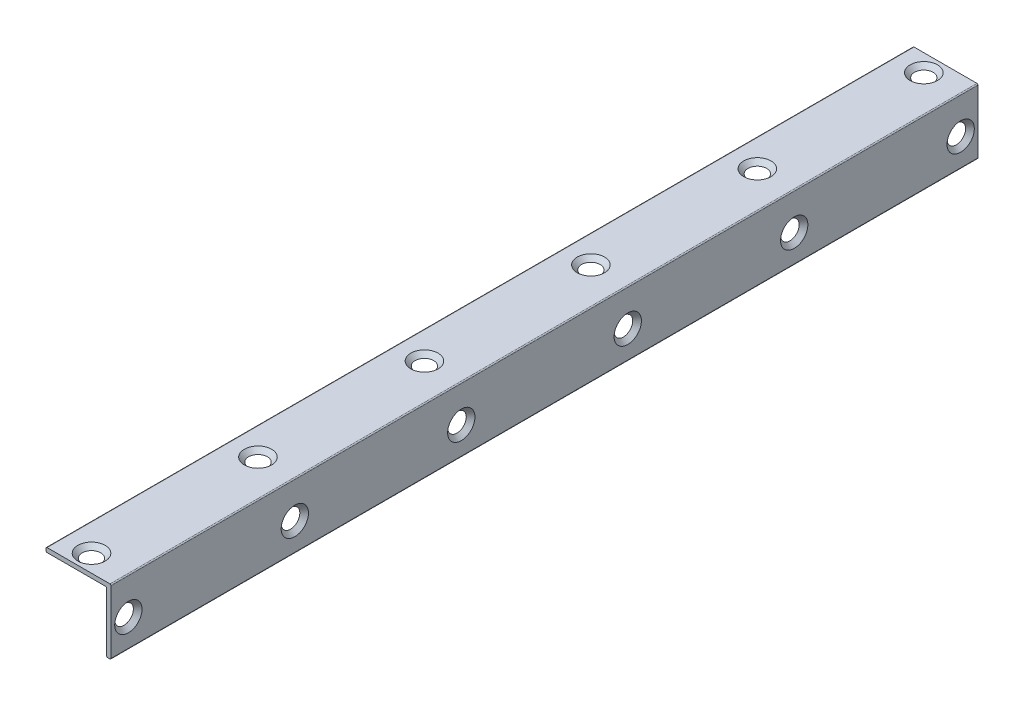
ISO-10303-21;
HEADER;
FILE_DESCRIPTION(('STEP AP214'),'2;1');
FILE_NAME('part.step','',(''),(''),'','','');
FILE_SCHEMA(('AUTOMOTIVE_DESIGN { 1 0 10303 214 1 1 1 1 }'));
ENDSEC;
DATA;
#1=APPLICATION_CONTEXT('core data for automotive mechanical design processes');
#2=APPLICATION_PROTOCOL_DEFINITION('international standard','automotive_design',2000,#1);
#3=PRODUCT_CONTEXT('',#1,'mechanical');
#4=PRODUCT('Part','Part','',(#3));
#5=PRODUCT_RELATED_PRODUCT_CATEGORY('part','',(#4));
#6=PRODUCT_DEFINITION_FORMATION('','',#4);
#7=PRODUCT_DEFINITION_CONTEXT('part definition',#1,'design');
#8=PRODUCT_DEFINITION('design','',#6,#7);
#9=PRODUCT_DEFINITION_SHAPE('','',#8);
#10=(LENGTH_UNIT() NAMED_UNIT(*) SI_UNIT(.MILLI.,.METRE.));
#11=(NAMED_UNIT(*) PLANE_ANGLE_UNIT() SI_UNIT($,.RADIAN.));
#12=(NAMED_UNIT(*) SI_UNIT($,.STERADIAN.) SOLID_ANGLE_UNIT());
#13=UNCERTAINTY_MEASURE_WITH_UNIT(LENGTH_MEASURE(1.E-05),#10,'distance_accuracy_value','');
#14=(GEOMETRIC_REPRESENTATION_CONTEXT(3) GLOBAL_UNCERTAINTY_ASSIGNED_CONTEXT((#13)) GLOBAL_UNIT_ASSIGNED_CONTEXT((#10,
#11,#12)) REPRESENTATION_CONTEXT('',''));
#15=CARTESIAN_POINT('',(0.,0.,0.));
#16=DIRECTION('',(0.,0.,1.));
#17=DIRECTION('',(1.,0.,0.));
#18=AXIS2_PLACEMENT_3D('',#15,#16,#17);
#19=CARTESIAN_POINT('',(0.,15.,200.));
#20=DIRECTION('',(0.,-1.,0.));
#21=DIRECTION('',(1.,0.,0.));
#22=AXIS2_PLACEMENT_3D('',#19,#20,#21);
#23=PLANE('',#22);
#24=CARTESIAN_POINT('',(-8.5,15.,157.6));
#25=DIRECTION('',(0.,1.,0.));
#26=DIRECTION('',(0.,0.,1.));
#27=AXIS2_PLACEMENT_3D('',#24,#25,#26);
#28=CIRCLE('',#27,3.15);
#29=CARTESIAN_POINT('',(-8.5,15.,160.75));
#30=VERTEX_POINT('',#29);
#31=EDGE_CURVE('E269',#30,#30,#28,.T.);
#32=ORIENTED_EDGE('',*,*,#31,.F.);
#33=EDGE_LOOP('',(#32));
#34=FACE_BOUND('',#33,.T.);
#35=CARTESIAN_POINT('',(-8.5,15.,80.8));
#36=DIRECTION('',(0.,1.,0.));
#37=DIRECTION('',(0.,0.,1.));
#38=AXIS2_PLACEMENT_3D('',#35,#36,#37);
#39=CIRCLE('',#38,3.15);
#40=CARTESIAN_POINT('',(-8.5,15.,83.95));
#41=VERTEX_POINT('',#40);
#42=EDGE_CURVE('E257',#41,#41,#39,.T.);
#43=ORIENTED_EDGE('',*,*,#42,.F.);
#44=EDGE_LOOP('',(#43));
#45=FACE_BOUND('',#44,.T.);
#46=CARTESIAN_POINT('',(-8.5,15.,4.));
#47=DIRECTION('',(0.,1.,0.));
#48=DIRECTION('',(0.,0.,1.));
#49=AXIS2_PLACEMENT_3D('',#46,#47,#48);
#50=CIRCLE('',#49,3.15);
#51=CARTESIAN_POINT('',(-8.5,15.,7.15));
#52=VERTEX_POINT('',#51);
#53=EDGE_CURVE('E245',#52,#52,#50,.T.);
#54=ORIENTED_EDGE('',*,*,#53,.F.);
#55=EDGE_LOOP('',(#54));
#56=FACE_BOUND('',#55,.T.);
#57=DIRECTION('',(-1.,0.,0.));
#58=VECTOR('',#57,1.);
#59=CARTESIAN_POINT('',(0.,15.,200.));
#60=LINE('',#59,#58);
#61=CARTESIAN_POINT('',(-0.25,15.,200.));
#62=VERTEX_POINT('',#61);
#63=CARTESIAN_POINT('',(-14.75,15.,200.));
#64=VERTEX_POINT('',#63);
#65=EDGE_CURVE('E147',#62,#64,#60,.T.);
#66=ORIENTED_EDGE('',*,*,#65,.F.);
#67=DIRECTION('',(0.,0.,-1.));
#68=VECTOR('',#67,1.);
#69=CARTESIAN_POINT('',(-0.25,15.,200.));
#70=LINE('',#69,#68);
#71=CARTESIAN_POINT('',(-0.25,15.,0.));
#72=VERTEX_POINT('',#71);
#73=EDGE_CURVE('E186',#62,#72,#70,.T.);
#74=ORIENTED_EDGE('',*,*,#73,.T.);
#75=DIRECTION('',(-1.,0.,0.));
#76=VECTOR('',#75,1.);
#77=CARTESIAN_POINT('',(0.,15.,0.));
#78=LINE('',#77,#76);
#79=CARTESIAN_POINT('',(-14.75,15.,0.));
#80=VERTEX_POINT('',#79);
#81=EDGE_CURVE('E197',#72,#80,#78,.T.);
#82=ORIENTED_EDGE('',*,*,#81,.T.);
#83=DIRECTION('',(0.,0.,-1.));
#84=VECTOR('',#83,1.);
#85=CARTESIAN_POINT('',(-14.75,15.,200.));
#86=LINE('',#85,#84);
#87=EDGE_CURVE('E184',#80,#64,#86,.F.);
#88=ORIENTED_EDGE('',*,*,#87,.T.);
#89=EDGE_LOOP('',(#66,#74,#82,#88));
#90=FACE_BOUND('',#89,.T.);
#91=CARTESIAN_POINT('',(-8.5,15.,42.4));
#92=DIRECTION('',(0.,1.,0.));
#93=DIRECTION('',(0.,0.,1.));
#94=AXIS2_PLACEMENT_3D('',#91,#92,#93);
#95=CIRCLE('',#94,3.15);
#96=CARTESIAN_POINT('',(-8.5,15.,45.55));
#97=VERTEX_POINT('',#96);
#98=EDGE_CURVE('E251',#97,#97,#95,.T.);
#99=ORIENTED_EDGE('',*,*,#98,.F.);
#100=EDGE_LOOP('',(#99));
#101=FACE_BOUND('',#100,.T.);
#102=CARTESIAN_POINT('',(-8.5,15.,119.2));
#103=DIRECTION('',(0.,1.,0.));
#104=DIRECTION('',(0.,0.,1.));
#105=AXIS2_PLACEMENT_3D('',#102,#103,#104);
#106=CIRCLE('',#105,3.15);
#107=CARTESIAN_POINT('',(-8.5,15.,122.35));
#108=VERTEX_POINT('',#107);
#109=EDGE_CURVE('E263',#108,#108,#106,.T.);
#110=ORIENTED_EDGE('',*,*,#109,.F.);
#111=EDGE_LOOP('',(#110));
#112=FACE_BOUND('',#111,.T.);
#113=CARTESIAN_POINT('',(-8.5,15.,196.));
#114=DIRECTION('',(0.,1.,0.));
#115=DIRECTION('',(0.,0.,1.));
#116=AXIS2_PLACEMENT_3D('',#113,#114,#115);
#117=CIRCLE('',#116,3.15);
#118=CARTESIAN_POINT('',(-8.5,15.,199.15));
#119=VERTEX_POINT('',#118);
#120=EDGE_CURVE('E275',#119,#119,#117,.T.);
#121=ORIENTED_EDGE('',*,*,#120,.F.);
#122=EDGE_LOOP('',(#121));
#123=FACE_BOUND('',#122,.T.);
#124=ADVANCED_FACE('F31',(#34,#45,#56,#90,#101,#112,#123),#23,.F.);
#125=CARTESIAN_POINT('',(0.,0.,200.));
#126=DIRECTION('',(-1.,0.,0.));
#127=DIRECTION('',(0.,0.,1.));
#128=AXIS2_PLACEMENT_3D('',#125,#126,#127);
#129=PLANE('',#128);
#130=CARTESIAN_POINT('',(0.,6.5,157.6));
#131=DIRECTION('',(1.,0.,0.));
#132=DIRECTION('',(0.,0.,-1.));
#133=AXIS2_PLACEMENT_3D('',#130,#131,#132);
#134=CIRCLE('',#133,3.15);
#135=CARTESIAN_POINT('',(0.,6.5,154.45));
#136=VERTEX_POINT('',#135);
#137=EDGE_CURVE('E233',#136,#136,#134,.T.);
#138=ORIENTED_EDGE('',*,*,#137,.F.);
#139=EDGE_LOOP('',(#138));
#140=FACE_BOUND('',#139,.T.);
#141=CARTESIAN_POINT('',(0.,6.5,80.8));
#142=DIRECTION('',(1.,0.,0.));
#143=DIRECTION('',(0.,0.,-1.));
#144=AXIS2_PLACEMENT_3D('',#141,#142,#143);
#145=CIRCLE('',#144,3.15);
#146=CARTESIAN_POINT('',(0.,6.5,77.65));
#147=VERTEX_POINT('',#146);
#148=EDGE_CURVE('E221',#147,#147,#145,.T.);
#149=ORIENTED_EDGE('',*,*,#148,.F.);
#150=EDGE_LOOP('',(#149));
#151=FACE_BOUND('',#150,.T.);
#152=CARTESIAN_POINT('',(0.,6.5,4.));
#153=DIRECTION('',(1.,0.,0.));
#154=DIRECTION('',(0.,0.,-1.));
#155=AXIS2_PLACEMENT_3D('',#152,#153,#154);
#156=CIRCLE('',#155,3.15);
#157=CARTESIAN_POINT('',(0.,6.5,0.850000000000005));
#158=VERTEX_POINT('',#157);
#159=EDGE_CURVE('E209',#158,#158,#156,.T.);
#160=ORIENTED_EDGE('',*,*,#159,.F.);
#161=EDGE_LOOP('',(#160));
#162=FACE_BOUND('',#161,.T.);
#163=DIRECTION('',(0.,1.,0.));
#164=VECTOR('',#163,1.);
#165=CARTESIAN_POINT('',(0.,0.,200.));
#166=LINE('',#165,#164);
#167=CARTESIAN_POINT('',(0.,0.25,200.));
#168=VERTEX_POINT('',#167);
#169=CARTESIAN_POINT('',(0.,14.75,200.));
#170=VERTEX_POINT('',#169);
#171=EDGE_CURVE('E141',#168,#170,#166,.T.);
#172=ORIENTED_EDGE('',*,*,#171,.F.);
#173=DIRECTION('',(0.,0.,-1.));
#174=VECTOR('',#173,1.);
#175=CARTESIAN_POINT('',(0.,0.25,200.));
#176=LINE('',#175,#174);
#177=CARTESIAN_POINT('',(0.,0.25,0.));
#178=VERTEX_POINT('',#177);
#179=EDGE_CURVE('E181',#168,#178,#176,.T.);
#180=ORIENTED_EDGE('',*,*,#179,.T.);
#181=DIRECTION('',(0.,1.,0.));
#182=VECTOR('',#181,1.);
#183=CARTESIAN_POINT('',(0.,0.,0.));
#184=LINE('',#183,#182);
#185=CARTESIAN_POINT('',(0.,14.75,0.));
#186=VERTEX_POINT('',#185);
#187=EDGE_CURVE('E198',#178,#186,#184,.T.);
#188=ORIENTED_EDGE('',*,*,#187,.T.);
#189=DIRECTION('',(0.,0.,-1.));
#190=VECTOR('',#189,1.);
#191=CARTESIAN_POINT('',(0.,14.75,200.));
#192=LINE('',#191,#190);
#193=EDGE_CURVE('E179',#186,#170,#192,.F.);
#194=ORIENTED_EDGE('',*,*,#193,.T.);
#195=EDGE_LOOP('',(#172,#180,#188,#194));
#196=FACE_BOUND('',#195,.T.);
#197=CARTESIAN_POINT('',(0.,6.5,42.4));
#198=DIRECTION('',(1.,0.,0.));
#199=DIRECTION('',(0.,0.,-1.));
#200=AXIS2_PLACEMENT_3D('',#197,#198,#199);
#201=CIRCLE('',#200,3.15);
#202=CARTESIAN_POINT('',(0.,6.5,39.25));
#203=VERTEX_POINT('',#202);
#204=EDGE_CURVE('E215',#203,#203,#201,.T.);
#205=ORIENTED_EDGE('',*,*,#204,.F.);
#206=EDGE_LOOP('',(#205));
#207=FACE_BOUND('',#206,.T.);
#208=CARTESIAN_POINT('',(0.,6.5,119.2));
#209=DIRECTION('',(1.,0.,0.));
#210=DIRECTION('',(0.,0.,-1.));
#211=AXIS2_PLACEMENT_3D('',#208,#209,#210);
#212=CIRCLE('',#211,3.15);
#213=CARTESIAN_POINT('',(0.,6.5,116.05));
#214=VERTEX_POINT('',#213);
#215=EDGE_CURVE('E227',#214,#214,#212,.T.);
#216=ORIENTED_EDGE('',*,*,#215,.F.);
#217=EDGE_LOOP('',(#216));
#218=FACE_BOUND('',#217,.T.);
#219=CARTESIAN_POINT('',(0.,6.5,196.));
#220=DIRECTION('',(1.,0.,0.));
#221=DIRECTION('',(0.,0.,-1.));
#222=AXIS2_PLACEMENT_3D('',#219,#220,#221);
#223=CIRCLE('',#222,3.15);
#224=CARTESIAN_POINT('',(0.,6.5,192.85));
#225=VERTEX_POINT('',#224);
#226=EDGE_CURVE('E239',#225,#225,#223,.T.);
#227=ORIENTED_EDGE('',*,*,#226,.F.);
#228=EDGE_LOOP('',(#227));
#229=FACE_BOUND('',#228,.T.);
#230=ADVANCED_FACE('F282',(#140,#151,#162,#196,#207,#218,#229),#129,.F.);
#231=CARTESIAN_POINT('',(-1.,0.,200.));
#232=DIRECTION('',(0.,1.,0.));
#233=DIRECTION('',(0.,0.,1.));
#234=AXIS2_PLACEMENT_3D('',#231,#232,#233);
#235=PLANE('',#234);
#236=DIRECTION('',(1.,0.,0.));
#237=VECTOR('',#236,1.);
#238=CARTESIAN_POINT('',(-1.,0.,200.));
#239=LINE('',#238,#237);
#240=CARTESIAN_POINT('',(-0.750000000000001,0.,200.));
#241=VERTEX_POINT('',#240);
#242=CARTESIAN_POINT('',(-0.25,0.,200.));
#243=VERTEX_POINT('',#242);
#244=EDGE_CURVE('E138',#241,#243,#239,.T.);
#245=ORIENTED_EDGE('',*,*,#244,.F.);
#246=DIRECTION('',(0.,0.,-1.));
#247=VECTOR('',#246,1.);
#248=CARTESIAN_POINT('',(-0.750000000000001,0.,200.));
#249=LINE('',#248,#247);
#250=CARTESIAN_POINT('',(-0.750000000000001,0.,0.));
#251=VERTEX_POINT('',#250);
#252=EDGE_CURVE('E156',#241,#251,#249,.T.);
#253=ORIENTED_EDGE('',*,*,#252,.T.);
#254=DIRECTION('',(1.,0.,0.));
#255=VECTOR('',#254,1.);
#256=CARTESIAN_POINT('',(-1.,0.,0.));
#257=LINE('',#256,#255);
#258=CARTESIAN_POINT('',(-0.25,0.,0.));
#259=VERTEX_POINT('',#258);
#260=EDGE_CURVE('E203',#251,#259,#257,.T.);
#261=ORIENTED_EDGE('',*,*,#260,.T.);
#262=DIRECTION('',(0.,0.,-1.));
#263=VECTOR('',#262,1.);
#264=CARTESIAN_POINT('',(-0.25,0.,200.));
#265=LINE('',#264,#263);
#266=EDGE_CURVE('E133',#259,#243,#265,.F.);
#267=ORIENTED_EDGE('',*,*,#266,.T.);
#268=EDGE_LOOP('',(#245,#253,#261,#267));
#269=FACE_BOUND('',#268,.T.);
#270=ADVANCED_FACE('F33',(#269),#235,.F.);
#271=CARTESIAN_POINT('',(-15.,15.,200.));
#272=DIRECTION('',(1.,0.,0.));
#273=DIRECTION('',(0.,1.,0.));
#274=AXIS2_PLACEMENT_3D('',#271,#272,#273);
#275=PLANE('',#274);
#276=DIRECTION('',(0.,-1.,0.));
#277=VECTOR('',#276,1.);
#278=CARTESIAN_POINT('',(-15.,15.,200.));
#279=LINE('',#278,#277);
#280=CARTESIAN_POINT('',(-15.,14.75,200.));
#281=VERTEX_POINT('',#280);
#282=CARTESIAN_POINT('',(-15.,14.25,200.));
#283=VERTEX_POINT('',#282);
#284=EDGE_CURVE('E150',#281,#283,#279,.T.);
#285=ORIENTED_EDGE('',*,*,#284,.F.);
#286=DIRECTION('',(0.,0.,-1.));
#287=VECTOR('',#286,1.);
#288=CARTESIAN_POINT('',(-15.,14.75,200.));
#289=LINE('',#288,#287);
#290=CARTESIAN_POINT('',(-15.,14.75,0.));
#291=VERTEX_POINT('',#290);
#292=EDGE_CURVE('E39',#281,#291,#289,.T.);
#293=ORIENTED_EDGE('',*,*,#292,.T.);
#294=DIRECTION('',(0.,-1.,0.));
#295=VECTOR('',#294,1.);
#296=CARTESIAN_POINT('',(-15.,15.,0.));
#297=LINE('',#296,#295);
#298=CARTESIAN_POINT('',(-15.,14.25,0.));
#299=VERTEX_POINT('',#298);
#300=EDGE_CURVE('E125',#291,#299,#297,.T.);
#301=ORIENTED_EDGE('',*,*,#300,.T.);
#302=DIRECTION('',(0.,0.,-1.));
#303=VECTOR('',#302,1.);
#304=CARTESIAN_POINT('',(-15.,14.25,200.));
#305=LINE('',#304,#303);
#306=EDGE_CURVE('E54',#299,#283,#305,.F.);
#307=ORIENTED_EDGE('',*,*,#306,.T.);
#308=EDGE_LOOP('',(#285,#293,#301,#307));
#309=FACE_BOUND('',#308,.T.);
#310=ADVANCED_FACE('F192',(#309),#275,.F.);
#311=CARTESIAN_POINT('',(-15.,14.,200.));
#312=DIRECTION('',(0.,1.,0.));
#313=DIRECTION('',(-1.,0.,0.));
#314=AXIS2_PLACEMENT_3D('',#311,#312,#313);
#315=PLANE('',#314);
#316=CARTESIAN_POINT('',(-8.5,14.,196.));
#317=DIRECTION('',(0.,1.,0.));
#318=DIRECTION('',(-1.,0.,0.));
#319=AXIS2_PLACEMENT_3D('',#316,#317,#318);
#320=CIRCLE('',#319,2.14999999999999);
#321=CARTESIAN_POINT('',(-10.65,14.,196.));
#322=VERTEX_POINT('',#321);
#323=EDGE_CURVE('E272',#322,#322,#320,.T.);
#324=ORIENTED_EDGE('',*,*,#323,.T.);
#325=EDGE_LOOP('',(#324));
#326=FACE_BOUND('',#325,.T.);
#327=CARTESIAN_POINT('',(-8.5,14.,157.6));
#328=DIRECTION('',(0.,1.,0.));
#329=DIRECTION('',(-1.,0.,0.));
#330=AXIS2_PLACEMENT_3D('',#327,#328,#329);
#331=CIRCLE('',#330,2.14999999999999);
#332=CARTESIAN_POINT('',(-10.65,14.,157.6));
#333=VERTEX_POINT('',#332);
#334=EDGE_CURVE('E266',#333,#333,#331,.T.);
#335=ORIENTED_EDGE('',*,*,#334,.T.);
#336=EDGE_LOOP('',(#335));
#337=FACE_BOUND('',#336,.T.);
#338=CARTESIAN_POINT('',(-8.5,14.,119.2));
#339=DIRECTION('',(0.,1.,0.));
#340=DIRECTION('',(-1.,0.,0.));
#341=AXIS2_PLACEMENT_3D('',#338,#339,#340);
#342=CIRCLE('',#341,2.14999999999999);
#343=CARTESIAN_POINT('',(-10.65,14.,119.2));
#344=VERTEX_POINT('',#343);
#345=EDGE_CURVE('E260',#344,#344,#342,.T.);
#346=ORIENTED_EDGE('',*,*,#345,.T.);
#347=EDGE_LOOP('',(#346));
#348=FACE_BOUND('',#347,.T.);
#349=CARTESIAN_POINT('',(-8.5,14.,80.8));
#350=DIRECTION('',(0.,1.,0.));
#351=DIRECTION('',(-1.,0.,0.));
#352=AXIS2_PLACEMENT_3D('',#349,#350,#351);
#353=CIRCLE('',#352,2.14999999999999);
#354=CARTESIAN_POINT('',(-10.65,14.,80.8));
#355=VERTEX_POINT('',#354);
#356=EDGE_CURVE('E254',#355,#355,#353,.T.);
#357=ORIENTED_EDGE('',*,*,#356,.T.);
#358=EDGE_LOOP('',(#357));
#359=FACE_BOUND('',#358,.T.);
#360=CARTESIAN_POINT('',(-8.5,14.,42.4));
#361=DIRECTION('',(0.,1.,0.));
#362=DIRECTION('',(-1.,0.,0.));
#363=AXIS2_PLACEMENT_3D('',#360,#361,#362);
#364=CIRCLE('',#363,2.14999999999999);
#365=CARTESIAN_POINT('',(-10.65,14.,42.4));
#366=VERTEX_POINT('',#365);
#367=EDGE_CURVE('E248',#366,#366,#364,.T.);
#368=ORIENTED_EDGE('',*,*,#367,.T.);
#369=EDGE_LOOP('',(#368));
#370=FACE_BOUND('',#369,.T.);
#371=CARTESIAN_POINT('',(-8.5,14.,4.));
#372=DIRECTION('',(0.,1.,0.));
#373=DIRECTION('',(-1.,0.,0.));
#374=AXIS2_PLACEMENT_3D('',#371,#372,#373);
#375=CIRCLE('',#374,2.14999999999999);
#376=CARTESIAN_POINT('',(-10.65,14.,4.));
#377=VERTEX_POINT('',#376);
#378=EDGE_CURVE('E242',#377,#377,#375,.T.);
#379=ORIENTED_EDGE('',*,*,#378,.T.);
#380=EDGE_LOOP('',(#379));
#381=FACE_BOUND('',#380,.T.);
#382=DIRECTION('',(1.,0.,0.));
#383=VECTOR('',#382,1.);
#384=CARTESIAN_POINT('',(-15.,14.,200.));
#385=LINE('',#384,#383);
#386=CARTESIAN_POINT('',(-14.75,14.,200.));
#387=VERTEX_POINT('',#386);
#388=CARTESIAN_POINT('',(-1.,14.,200.));
#389=VERTEX_POINT('',#388);
#390=EDGE_CURVE('E152',#387,#389,#385,.T.);
#391=ORIENTED_EDGE('',*,*,#390,.F.);
#392=DIRECTION('',(0.,0.,-1.));
#393=VECTOR('',#392,1.);
#394=CARTESIAN_POINT('',(-14.75,14.,200.));
#395=LINE('',#394,#393);
#396=CARTESIAN_POINT('',(-14.75,14.,0.));
#397=VERTEX_POINT('',#396);
#398=EDGE_CURVE('E11',#387,#397,#395,.T.);
#399=ORIENTED_EDGE('',*,*,#398,.T.);
#400=DIRECTION('',(1.,0.,0.));
#401=VECTOR('',#400,1.);
#402=CARTESIAN_POINT('',(-15.,14.,0.));
#403=LINE('',#402,#401);
#404=CARTESIAN_POINT('',(-1.,14.,0.));
#405=VERTEX_POINT('',#404);
#406=EDGE_CURVE('E116',#397,#405,#403,.T.);
#407=ORIENTED_EDGE('',*,*,#406,.T.);
#408=DIRECTION('',(0.,0.,-1.));
#409=VECTOR('',#408,1.);
#410=CARTESIAN_POINT('',(-1.,14.,200.));
#411=LINE('',#410,#409);
#412=EDGE_CURVE('E119',#389,#405,#411,.T.);
#413=ORIENTED_EDGE('',*,*,#412,.F.);
#414=EDGE_LOOP('',(#391,#399,#407,#413));
#415=FACE_BOUND('',#414,.T.);
#416=ADVANCED_FACE('F118',(#326,#337,#348,#359,#370,#381,#415),#315,.F.);
#417=CARTESIAN_POINT('',(-1.,14.,200.));
#418=DIRECTION('',(1.,0.,0.));
#419=DIRECTION('',(0.,1.,0.));
#420=AXIS2_PLACEMENT_3D('',#417,#418,#419);
#421=PLANE('',#420);
#422=CARTESIAN_POINT('',(-1.,6.5,196.));
#423=DIRECTION('',(1.,0.,0.));
#424=DIRECTION('',(0.,1.,0.));
#425=AXIS2_PLACEMENT_3D('',#422,#423,#424);
#426=CIRCLE('',#425,2.14999999999999);
#427=CARTESIAN_POINT('',(-1.,8.65,196.));
#428=VERTEX_POINT('',#427);
#429=EDGE_CURVE('E236',#428,#428,#426,.T.);
#430=ORIENTED_EDGE('',*,*,#429,.T.);
#431=EDGE_LOOP('',(#430));
#432=FACE_BOUND('',#431,.T.);
#433=CARTESIAN_POINT('',(-1.,6.5,157.6));
#434=DIRECTION('',(1.,0.,0.));
#435=DIRECTION('',(0.,1.,0.));
#436=AXIS2_PLACEMENT_3D('',#433,#434,#435);
#437=CIRCLE('',#436,2.14999999999999);
#438=CARTESIAN_POINT('',(-1.,8.65,157.6));
#439=VERTEX_POINT('',#438);
#440=EDGE_CURVE('E230',#439,#439,#437,.T.);
#441=ORIENTED_EDGE('',*,*,#440,.T.);
#442=EDGE_LOOP('',(#441));
#443=FACE_BOUND('',#442,.T.);
#444=CARTESIAN_POINT('',(-1.,6.5,119.2));
#445=DIRECTION('',(1.,0.,0.));
#446=DIRECTION('',(0.,1.,0.));
#447=AXIS2_PLACEMENT_3D('',#444,#445,#446);
#448=CIRCLE('',#447,2.14999999999999);
#449=CARTESIAN_POINT('',(-1.,8.65,119.2));
#450=VERTEX_POINT('',#449);
#451=EDGE_CURVE('E224',#450,#450,#448,.T.);
#452=ORIENTED_EDGE('',*,*,#451,.T.);
#453=EDGE_LOOP('',(#452));
#454=FACE_BOUND('',#453,.T.);
#455=CARTESIAN_POINT('',(-1.,6.5,80.8));
#456=DIRECTION('',(1.,0.,0.));
#457=DIRECTION('',(0.,1.,0.));
#458=AXIS2_PLACEMENT_3D('',#455,#456,#457);
#459=CIRCLE('',#458,2.14999999999999);
#460=CARTESIAN_POINT('',(-1.,8.65,80.8));
#461=VERTEX_POINT('',#460);
#462=EDGE_CURVE('E218',#461,#461,#459,.T.);
#463=ORIENTED_EDGE('',*,*,#462,.T.);
#464=EDGE_LOOP('',(#463));
#465=FACE_BOUND('',#464,.T.);
#466=CARTESIAN_POINT('',(-1.,6.5,42.4));
#467=DIRECTION('',(1.,0.,0.));
#468=DIRECTION('',(0.,1.,0.));
#469=AXIS2_PLACEMENT_3D('',#466,#467,#468);
#470=CIRCLE('',#469,2.14999999999999);
#471=CARTESIAN_POINT('',(-1.,8.65,42.4));
#472=VERTEX_POINT('',#471);
#473=EDGE_CURVE('E212',#472,#472,#470,.T.);
#474=ORIENTED_EDGE('',*,*,#473,.T.);
#475=EDGE_LOOP('',(#474));
#476=FACE_BOUND('',#475,.T.);
#477=CARTESIAN_POINT('',(-1.,6.5,4.));
#478=DIRECTION('',(1.,0.,0.));
#479=DIRECTION('',(0.,1.,0.));
#480=AXIS2_PLACEMENT_3D('',#477,#478,#479);
#481=CIRCLE('',#480,2.14999999999999);
#482=CARTESIAN_POINT('',(-1.,8.65,4.));
#483=VERTEX_POINT('',#482);
#484=EDGE_CURVE('E206',#483,#483,#481,.T.);
#485=ORIENTED_EDGE('',*,*,#484,.T.);
#486=EDGE_LOOP('',(#485));
#487=FACE_BOUND('',#486,.T.);
#488=DIRECTION('',(0.,-1.,0.));
#489=VECTOR('',#488,1.);
#490=CARTESIAN_POINT('',(-1.,14.,0.));
#491=LINE('',#490,#489);
#492=CARTESIAN_POINT('',(-1.,0.25,0.));
#493=VERTEX_POINT('',#492);
#494=EDGE_CURVE('E124',#405,#493,#491,.T.);
#495=ORIENTED_EDGE('',*,*,#494,.T.);
#496=DIRECTION('',(0.,0.,-1.));
#497=VECTOR('',#496,1.);
#498=CARTESIAN_POINT('',(-1.,0.25,200.));
#499=LINE('',#498,#497);
#500=CARTESIAN_POINT('',(-1.,0.25,200.));
#501=VERTEX_POINT('',#500);
#502=EDGE_CURVE('E168',#493,#501,#499,.F.);
#503=ORIENTED_EDGE('',*,*,#502,.T.);
#504=DIRECTION('',(0.,-1.,0.));
#505=VECTOR('',#504,1.);
#506=CARTESIAN_POINT('',(-1.,14.,200.));
#507=LINE('',#506,#505);
#508=EDGE_CURVE('E132',#389,#501,#507,.T.);
#509=ORIENTED_EDGE('',*,*,#508,.F.);
#510=ORIENTED_EDGE('',*,*,#412,.T.);
#511=EDGE_LOOP('',(#495,#503,#509,#510));
#512=FACE_BOUND('',#511,.T.);
#513=ADVANCED_FACE('F129',(#432,#443,#454,#465,#476,#487,#512),#421,.F.);
#514=CARTESIAN_POINT('',(0.,0.,200.));
#515=DIRECTION('',(0.,0.,1.));
#516=DIRECTION('',(1.,0.,0.));
#517=AXIS2_PLACEMENT_3D('',#514,#515,#516);
#518=PLANE('',#517);
#519=ORIENTED_EDGE('',*,*,#508,.T.);
#520=CARTESIAN_POINT('',(-0.750000000000001,0.25,200.));
#521=DIRECTION('',(0.,0.,1.));
#522=DIRECTION('',(1.,0.,0.));
#523=AXIS2_PLACEMENT_3D('',#520,#521,#522);
#524=CIRCLE('',#523,0.25);
#525=EDGE_CURVE('E177',#501,#241,#524,.T.);
#526=ORIENTED_EDGE('',*,*,#525,.T.);
#527=ORIENTED_EDGE('',*,*,#244,.T.);
#528=CARTESIAN_POINT('',(-0.25,0.25,200.));
#529=DIRECTION('',(0.,0.,1.));
#530=DIRECTION('',(1.,0.,0.));
#531=AXIS2_PLACEMENT_3D('',#528,#529,#530);
#532=CIRCLE('',#531,0.25);
#533=EDGE_CURVE('E175',#243,#168,#532,.T.);
#534=ORIENTED_EDGE('',*,*,#533,.T.);
#535=ORIENTED_EDGE('',*,*,#171,.T.);
#536=CARTESIAN_POINT('',(-0.25,14.75,200.));
#537=DIRECTION('',(0.,0.,1.));
#538=DIRECTION('',(1.,0.,0.));
#539=AXIS2_PLACEMENT_3D('',#536,#537,#538);
#540=CIRCLE('',#539,0.25);
#541=EDGE_CURVE('E173',#170,#62,#540,.T.);
#542=ORIENTED_EDGE('',*,*,#541,.T.);
#543=ORIENTED_EDGE('',*,*,#65,.T.);
#544=CARTESIAN_POINT('',(-14.75,14.75,200.));
#545=DIRECTION('',(0.,0.,1.));
#546=DIRECTION('',(1.,0.,0.));
#547=AXIS2_PLACEMENT_3D('',#544,#545,#546);
#548=CIRCLE('',#547,0.25);
#549=EDGE_CURVE('E171',#64,#281,#548,.T.);
#550=ORIENTED_EDGE('',*,*,#549,.T.);
#551=ORIENTED_EDGE('',*,*,#284,.T.);
#552=CARTESIAN_POINT('',(-14.75,14.25,200.));
#553=DIRECTION('',(0.,0.,1.));
#554=DIRECTION('',(1.,0.,0.));
#555=AXIS2_PLACEMENT_3D('',#552,#553,#554);
#556=CIRCLE('',#555,0.25);
#557=EDGE_CURVE('E46',#283,#387,#556,.T.);
#558=ORIENTED_EDGE('',*,*,#557,.T.);
#559=ORIENTED_EDGE('',*,*,#390,.T.);
#560=EDGE_LOOP('',(#519,#526,#527,#534,#535,#542,#543,#550,#551,#558,#559));
#561=FACE_BOUND('',#560,.T.);
#562=ADVANCED_FACE('F299',(#561),#518,.T.);
#563=CARTESIAN_POINT('',(0.,0.,0.));
#564=DIRECTION('',(0.,0.,1.));
#565=DIRECTION('',(1.,0.,0.));
#566=AXIS2_PLACEMENT_3D('',#563,#564,#565);
#567=PLANE('',#566);
#568=ORIENTED_EDGE('',*,*,#260,.F.);
#569=CARTESIAN_POINT('',(-0.750000000000001,0.25,0.));
#570=DIRECTION('',(0.,0.,1.));
#571=DIRECTION('',(1.,0.,0.));
#572=AXIS2_PLACEMENT_3D('',#569,#570,#571);
#573=CIRCLE('',#572,0.25);
#574=EDGE_CURVE('E137',#251,#493,#573,.F.);
#575=ORIENTED_EDGE('',*,*,#574,.T.);
#576=ORIENTED_EDGE('',*,*,#494,.F.);
#577=ORIENTED_EDGE('',*,*,#406,.F.);
#578=CARTESIAN_POINT('',(-14.75,14.25,0.));
#579=DIRECTION('',(0.,0.,1.));
#580=DIRECTION('',(1.,0.,0.));
#581=AXIS2_PLACEMENT_3D('',#578,#579,#580);
#582=CIRCLE('',#581,0.25);
#583=EDGE_CURVE('E159',#397,#299,#582,.F.);
#584=ORIENTED_EDGE('',*,*,#583,.T.);
#585=ORIENTED_EDGE('',*,*,#300,.F.);
#586=CARTESIAN_POINT('',(-14.75,14.75,0.));
#587=DIRECTION('',(0.,0.,1.));
#588=DIRECTION('',(1.,0.,0.));
#589=AXIS2_PLACEMENT_3D('',#586,#587,#588);
#590=CIRCLE('',#589,0.25);
#591=EDGE_CURVE('E161',#291,#80,#590,.F.);
#592=ORIENTED_EDGE('',*,*,#591,.T.);
#593=ORIENTED_EDGE('',*,*,#81,.F.);
#594=CARTESIAN_POINT('',(-0.25,14.75,0.));
#595=DIRECTION('',(0.,0.,1.));
#596=DIRECTION('',(1.,0.,0.));
#597=AXIS2_PLACEMENT_3D('',#594,#595,#596);
#598=CIRCLE('',#597,0.25);
#599=EDGE_CURVE('E163',#72,#186,#598,.F.);
#600=ORIENTED_EDGE('',*,*,#599,.T.);
#601=ORIENTED_EDGE('',*,*,#187,.F.);
#602=CARTESIAN_POINT('',(-0.25,0.25,0.));
#603=DIRECTION('',(0.,0.,1.));
#604=DIRECTION('',(1.,0.,0.));
#605=AXIS2_PLACEMENT_3D('',#602,#603,#604);
#606=CIRCLE('',#605,0.25);
#607=EDGE_CURVE('E165',#178,#259,#606,.F.);
#608=ORIENTED_EDGE('',*,*,#607,.T.);
#609=EDGE_LOOP('',(#568,#575,#576,#577,#584,#585,#592,#593,#600,#601,#608));
#610=FACE_BOUND('',#609,.T.);
#611=ADVANCED_FACE('F136',(#610),#567,.F.);
#612=CARTESIAN_POINT('',(-0.750000000000001,0.25,200.));
#613=DIRECTION('',(0.,0.,-1.));
#614=DIRECTION('',(-1.,0.,0.));
#615=AXIS2_PLACEMENT_3D('',#612,#613,#614);
#616=CYLINDRICAL_SURFACE('',#615,0.25);
#617=ORIENTED_EDGE('',*,*,#525,.F.);
#618=ORIENTED_EDGE('',*,*,#502,.F.);
#619=ORIENTED_EDGE('',*,*,#574,.F.);
#620=ORIENTED_EDGE('',*,*,#252,.F.);
#621=EDGE_LOOP('',(#617,#618,#619,#620));
#622=FACE_BOUND('',#621,.T.);
#623=ADVANCED_FACE('F305',(#622),#616,.T.);
#624=CARTESIAN_POINT('',(-0.25,0.25,200.));
#625=DIRECTION('',(0.,0.,-1.));
#626=DIRECTION('',(-1.,0.,0.));
#627=AXIS2_PLACEMENT_3D('',#624,#625,#626);
#628=CYLINDRICAL_SURFACE('',#627,0.25);
#629=ORIENTED_EDGE('',*,*,#533,.F.);
#630=ORIENTED_EDGE('',*,*,#266,.F.);
#631=ORIENTED_EDGE('',*,*,#607,.F.);
#632=ORIENTED_EDGE('',*,*,#179,.F.);
#633=EDGE_LOOP('',(#629,#630,#631,#632));
#634=FACE_BOUND('',#633,.T.);
#635=ADVANCED_FACE('F308',(#634),#628,.T.);
#636=CARTESIAN_POINT('',(-0.25,14.75,200.));
#637=DIRECTION('',(0.,0.,-1.));
#638=DIRECTION('',(-1.,0.,0.));
#639=AXIS2_PLACEMENT_3D('',#636,#637,#638);
#640=CYLINDRICAL_SURFACE('',#639,0.25);
#641=ORIENTED_EDGE('',*,*,#541,.F.);
#642=ORIENTED_EDGE('',*,*,#193,.F.);
#643=ORIENTED_EDGE('',*,*,#599,.F.);
#644=ORIENTED_EDGE('',*,*,#73,.F.);
#645=EDGE_LOOP('',(#641,#642,#643,#644));
#646=FACE_BOUND('',#645,.T.);
#647=ADVANCED_FACE('F312',(#646),#640,.T.);
#648=CARTESIAN_POINT('',(-14.75,14.75,200.));
#649=DIRECTION('',(0.,0.,-1.));
#650=DIRECTION('',(-1.,0.,0.));
#651=AXIS2_PLACEMENT_3D('',#648,#649,#650);
#652=CYLINDRICAL_SURFACE('',#651,0.25);
#653=ORIENTED_EDGE('',*,*,#549,.F.);
#654=ORIENTED_EDGE('',*,*,#87,.F.);
#655=ORIENTED_EDGE('',*,*,#591,.F.);
#656=ORIENTED_EDGE('',*,*,#292,.F.);
#657=EDGE_LOOP('',(#653,#654,#655,#656));
#658=FACE_BOUND('',#657,.T.);
#659=ADVANCED_FACE('F316',(#658),#652,.T.);
#660=CARTESIAN_POINT('',(-14.75,14.25,200.));
#661=DIRECTION('',(0.,0.,-1.));
#662=DIRECTION('',(-1.,0.,0.));
#663=AXIS2_PLACEMENT_3D('',#660,#661,#662);
#664=CYLINDRICAL_SURFACE('',#663,0.25);
#665=ORIENTED_EDGE('',*,*,#557,.F.);
#666=ORIENTED_EDGE('',*,*,#306,.F.);
#667=ORIENTED_EDGE('',*,*,#583,.F.);
#668=ORIENTED_EDGE('',*,*,#398,.F.);
#669=EDGE_LOOP('',(#665,#666,#667,#668));
#670=FACE_BOUND('',#669,.T.);
#671=ADVANCED_FACE('F320',(#670),#664,.T.);
#672=CARTESIAN_POINT('',(0.,6.5,4.));
#673=DIRECTION('',(1.,0.,0.));
#674=DIRECTION('',(0.,0.,-1.));
#675=AXIS2_PLACEMENT_3D('',#672,#673,#674);
#676=CONICAL_SURFACE('',#675,3.15,0.785398163397449);
#677=ORIENTED_EDGE('',*,*,#484,.F.);
#678=EDGE_LOOP('',(#677));
#679=FACE_BOUND('',#678,.T.);
#680=ORIENTED_EDGE('',*,*,#159,.T.);
#681=EDGE_LOOP('',(#680));
#682=FACE_BOUND('',#681,.T.);
#683=ADVANCED_FACE('F323',(#679,#682),#676,.F.);
#684=CARTESIAN_POINT('',(0.,6.5,42.4));
#685=DIRECTION('',(1.,0.,0.));
#686=DIRECTION('',(0.,0.,-1.));
#687=AXIS2_PLACEMENT_3D('',#684,#685,#686);
#688=CONICAL_SURFACE('',#687,3.15,0.785398163397449);
#689=ORIENTED_EDGE('',*,*,#473,.F.);
#690=EDGE_LOOP('',(#689));
#691=FACE_BOUND('',#690,.T.);
#692=ORIENTED_EDGE('',*,*,#204,.T.);
#693=EDGE_LOOP('',(#692));
#694=FACE_BOUND('',#693,.T.);
#695=ADVANCED_FACE('F327',(#691,#694),#688,.F.);
#696=CARTESIAN_POINT('',(0.,6.5,80.8));
#697=DIRECTION('',(1.,0.,0.));
#698=DIRECTION('',(0.,0.,-1.));
#699=AXIS2_PLACEMENT_3D('',#696,#697,#698);
#700=CONICAL_SURFACE('',#699,3.15,0.785398163397449);
#701=ORIENTED_EDGE('',*,*,#462,.F.);
#702=EDGE_LOOP('',(#701));
#703=FACE_BOUND('',#702,.T.);
#704=ORIENTED_EDGE('',*,*,#148,.T.);
#705=EDGE_LOOP('',(#704));
#706=FACE_BOUND('',#705,.T.);
#707=ADVANCED_FACE('F331',(#703,#706),#700,.F.);
#708=CARTESIAN_POINT('',(0.,6.5,119.2));
#709=DIRECTION('',(1.,0.,0.));
#710=DIRECTION('',(0.,0.,-1.));
#711=AXIS2_PLACEMENT_3D('',#708,#709,#710);
#712=CONICAL_SURFACE('',#711,3.15,0.785398163397449);
#713=ORIENTED_EDGE('',*,*,#451,.F.);
#714=EDGE_LOOP('',(#713));
#715=FACE_BOUND('',#714,.T.);
#716=ORIENTED_EDGE('',*,*,#215,.T.);
#717=EDGE_LOOP('',(#716));
#718=FACE_BOUND('',#717,.T.);
#719=ADVANCED_FACE('F335',(#715,#718),#712,.F.);
#720=CARTESIAN_POINT('',(0.,6.5,157.6));
#721=DIRECTION('',(1.,0.,0.));
#722=DIRECTION('',(0.,0.,-1.));
#723=AXIS2_PLACEMENT_3D('',#720,#721,#722);
#724=CONICAL_SURFACE('',#723,3.15,0.785398163397449);
#725=ORIENTED_EDGE('',*,*,#440,.F.);
#726=EDGE_LOOP('',(#725));
#727=FACE_BOUND('',#726,.T.);
#728=ORIENTED_EDGE('',*,*,#137,.T.);
#729=EDGE_LOOP('',(#728));
#730=FACE_BOUND('',#729,.T.);
#731=ADVANCED_FACE('F339',(#727,#730),#724,.F.);
#732=CARTESIAN_POINT('',(0.,6.5,196.));
#733=DIRECTION('',(1.,0.,0.));
#734=DIRECTION('',(0.,0.,-1.));
#735=AXIS2_PLACEMENT_3D('',#732,#733,#734);
#736=CONICAL_SURFACE('',#735,3.15,0.785398163397449);
#737=ORIENTED_EDGE('',*,*,#429,.F.);
#738=EDGE_LOOP('',(#737));
#739=FACE_BOUND('',#738,.T.);
#740=ORIENTED_EDGE('',*,*,#226,.T.);
#741=EDGE_LOOP('',(#740));
#742=FACE_BOUND('',#741,.T.);
#743=ADVANCED_FACE('F343',(#739,#742),#736,.F.);
#744=CARTESIAN_POINT('',(-8.5,15.,4.));
#745=DIRECTION('',(0.,1.,0.));
#746=DIRECTION('',(0.,0.,1.));
#747=AXIS2_PLACEMENT_3D('',#744,#745,#746);
#748=CONICAL_SURFACE('',#747,3.15,0.78539816339745);
#749=ORIENTED_EDGE('',*,*,#378,.F.);
#750=EDGE_LOOP('',(#749));
#751=FACE_BOUND('',#750,.T.);
#752=ORIENTED_EDGE('',*,*,#53,.T.);
#753=EDGE_LOOP('',(#752));
#754=FACE_BOUND('',#753,.T.);
#755=ADVANCED_FACE('F347',(#751,#754),#748,.F.);
#756=CARTESIAN_POINT('',(-8.5,15.,42.4));
#757=DIRECTION('',(0.,1.,0.));
#758=DIRECTION('',(0.,0.,1.));
#759=AXIS2_PLACEMENT_3D('',#756,#757,#758);
#760=CONICAL_SURFACE('',#759,3.15,0.78539816339745);
#761=ORIENTED_EDGE('',*,*,#367,.F.);
#762=EDGE_LOOP('',(#761));
#763=FACE_BOUND('',#762,.T.);
#764=ORIENTED_EDGE('',*,*,#98,.T.);
#765=EDGE_LOOP('',(#764));
#766=FACE_BOUND('',#765,.T.);
#767=ADVANCED_FACE('F351',(#763,#766),#760,.F.);
#768=CARTESIAN_POINT('',(-8.5,15.,80.8));
#769=DIRECTION('',(0.,1.,0.));
#770=DIRECTION('',(0.,0.,1.));
#771=AXIS2_PLACEMENT_3D('',#768,#769,#770);
#772=CONICAL_SURFACE('',#771,3.15,0.78539816339745);
#773=ORIENTED_EDGE('',*,*,#356,.F.);
#774=EDGE_LOOP('',(#773));
#775=FACE_BOUND('',#774,.T.);
#776=ORIENTED_EDGE('',*,*,#42,.T.);
#777=EDGE_LOOP('',(#776));
#778=FACE_BOUND('',#777,.T.);
#779=ADVANCED_FACE('F355',(#775,#778),#772,.F.);
#780=CARTESIAN_POINT('',(-8.5,15.,119.2));
#781=DIRECTION('',(0.,1.,0.));
#782=DIRECTION('',(0.,0.,1.));
#783=AXIS2_PLACEMENT_3D('',#780,#781,#782);
#784=CONICAL_SURFACE('',#783,3.15,0.78539816339745);
#785=ORIENTED_EDGE('',*,*,#345,.F.);
#786=EDGE_LOOP('',(#785));
#787=FACE_BOUND('',#786,.T.);
#788=ORIENTED_EDGE('',*,*,#109,.T.);
#789=EDGE_LOOP('',(#788));
#790=FACE_BOUND('',#789,.T.);
#791=ADVANCED_FACE('F359',(#787,#790),#784,.F.);
#792=CARTESIAN_POINT('',(-8.5,15.,157.6));
#793=DIRECTION('',(0.,1.,0.));
#794=DIRECTION('',(0.,0.,1.));
#795=AXIS2_PLACEMENT_3D('',#792,#793,#794);
#796=CONICAL_SURFACE('',#795,3.15,0.78539816339745);
#797=ORIENTED_EDGE('',*,*,#334,.F.);
#798=EDGE_LOOP('',(#797));
#799=FACE_BOUND('',#798,.T.);
#800=ORIENTED_EDGE('',*,*,#31,.T.);
#801=EDGE_LOOP('',(#800));
#802=FACE_BOUND('',#801,.T.);
#803=ADVANCED_FACE('F363',(#799,#802),#796,.F.);
#804=CARTESIAN_POINT('',(-8.5,15.,196.));
#805=DIRECTION('',(0.,1.,0.));
#806=DIRECTION('',(0.,0.,1.));
#807=AXIS2_PLACEMENT_3D('',#804,#805,#806);
#808=CONICAL_SURFACE('',#807,3.15,0.78539816339745);
#809=ORIENTED_EDGE('',*,*,#323,.F.);
#810=EDGE_LOOP('',(#809));
#811=FACE_BOUND('',#810,.T.);
#812=ORIENTED_EDGE('',*,*,#120,.T.);
#813=EDGE_LOOP('',(#812));
#814=FACE_BOUND('',#813,.T.);
#815=ADVANCED_FACE('F279',(#811,#814),#808,.F.);
#816=CLOSED_SHELL('',(#124,#230,#270,#310,#416,#513,#562,#611,#623,#635,#647,#659,#671,#683,
#695,#707,#719,#731,#743,#755,#767,#779,#791,#803,#815));
#817=MANIFOLD_SOLID_BREP('B2',#816);
#818=ADVANCED_BREP_SHAPE_REPRESENTATION('',(#18,#817),#14);
#819=SHAPE_DEFINITION_REPRESENTATION(#9,#818);
ENDSEC;
END-ISO-10303-21;
